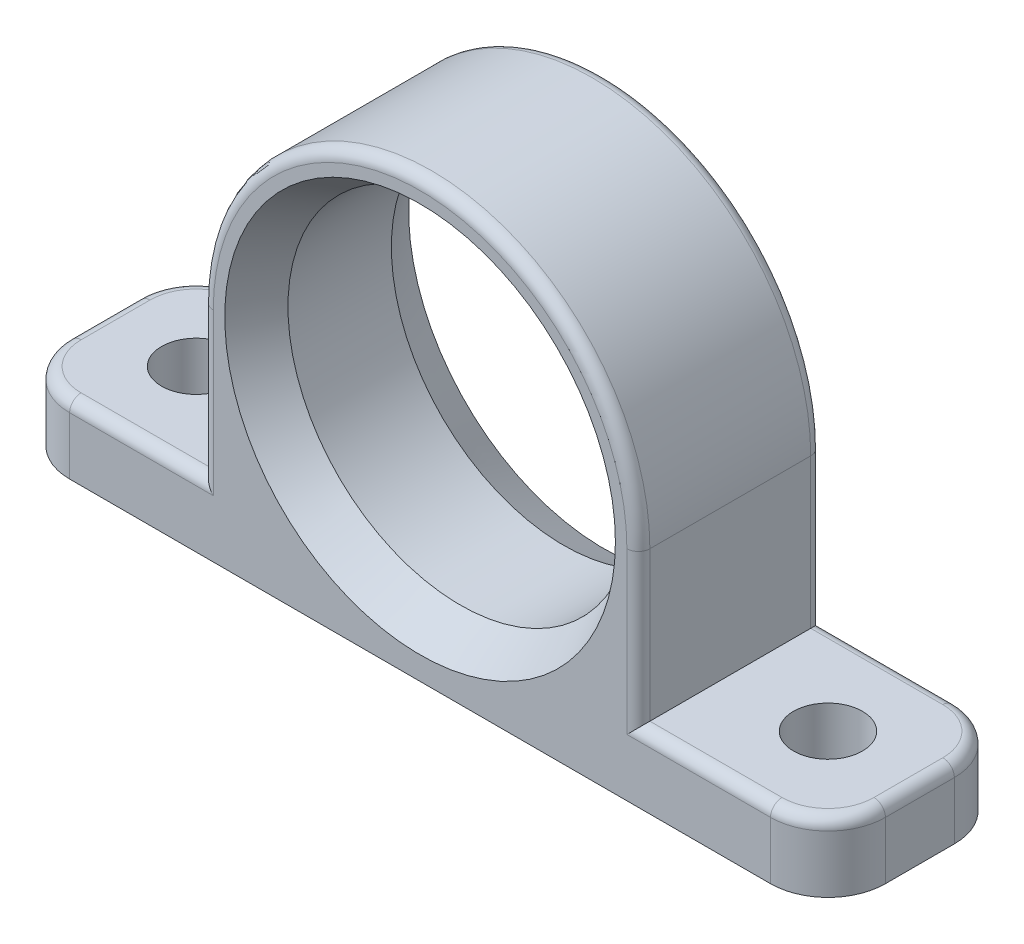
ISO-10303-21;
HEADER;
FILE_DESCRIPTION(('STEP AP214'),'2;1');
FILE_NAME('part.step','',(''),(''),'','','');
FILE_SCHEMA(('AUTOMOTIVE_DESIGN { 1 0 10303 214 1 1 1 1 }'));
ENDSEC;
DATA;
#1=APPLICATION_CONTEXT('core data for automotive mechanical design processes');
#2=APPLICATION_PROTOCOL_DEFINITION('international standard','automotive_design',2000,#1);
#3=PRODUCT_CONTEXT('',#1,'mechanical');
#4=PRODUCT('Part','Part','',(#3));
#5=PRODUCT_RELATED_PRODUCT_CATEGORY('part','',(#4));
#6=PRODUCT_DEFINITION_FORMATION('','',#4);
#7=PRODUCT_DEFINITION_CONTEXT('part definition',#1,'design');
#8=PRODUCT_DEFINITION('design','',#6,#7);
#9=PRODUCT_DEFINITION_SHAPE('','',#8);
#10=(LENGTH_UNIT() NAMED_UNIT(*) SI_UNIT(.MILLI.,.METRE.));
#11=(NAMED_UNIT(*) PLANE_ANGLE_UNIT() SI_UNIT($,.RADIAN.));
#12=(NAMED_UNIT(*) SI_UNIT($,.STERADIAN.) SOLID_ANGLE_UNIT());
#13=UNCERTAINTY_MEASURE_WITH_UNIT(LENGTH_MEASURE(1.E-05),#10,'distance_accuracy_value','');
#14=(GEOMETRIC_REPRESENTATION_CONTEXT(3) GLOBAL_UNCERTAINTY_ASSIGNED_CONTEXT((#13)) GLOBAL_UNIT_ASSIGNED_CONTEXT((#10,
#11,#12)) REPRESENTATION_CONTEXT('',''));
#15=CARTESIAN_POINT('',(0.,0.,0.));
#16=DIRECTION('',(0.,0.,1.));
#17=DIRECTION('',(1.,0.,0.));
#18=AXIS2_PLACEMENT_3D('',#15,#16,#17);
#19=CARTESIAN_POINT('',(0.,19.,16.));
#20=DIRECTION('',(0.,0.,1.));
#21=DIRECTION('',(1.,0.,0.));
#22=AXIS2_PLACEMENT_3D('',#19,#20,#21);
#23=PLANE('',#22);
#24=DIRECTION('',(0.,1.,0.));
#25=VECTOR('',#24,1.);
#26=CARTESIAN_POINT('',(30.5,6.,16.));
#27=LINE('',#26,#25);
#28=CARTESIAN_POINT('',(30.5,0.,16.));
#29=VERTEX_POINT('',#28);
#30=CARTESIAN_POINT('',(30.5,5.,16.));
#31=VERTEX_POINT('',#30);
#32=EDGE_CURVE('E220',#29,#31,#27,.T.);
#33=ORIENTED_EDGE('',*,*,#32,.T.);
#34=DIRECTION('',(-1.,0.,0.));
#35=VECTOR('',#34,1.);
#36=CARTESIAN_POINT('',(19.,5.,16.));
#37=LINE('',#36,#35);
#38=CARTESIAN_POINT('',(18.,5.,16.));
#39=VERTEX_POINT('',#38);
#40=EDGE_CURVE('E251',#31,#39,#37,.T.);
#41=ORIENTED_EDGE('',*,*,#40,.T.);
#42=DIRECTION('',(0.,1.,0.));
#43=VECTOR('',#42,1.);
#44=CARTESIAN_POINT('',(18.,19.,16.));
#45=LINE('',#44,#43);
#46=CARTESIAN_POINT('',(18.,19.,16.));
#47=VERTEX_POINT('',#46);
#48=EDGE_CURVE('E248',#39,#47,#45,.T.);
#49=ORIENTED_EDGE('',*,*,#48,.T.);
#50=CARTESIAN_POINT('',(0.,19.,16.));
#51=DIRECTION('',(0.,0.,1.));
#52=DIRECTION('',(1.,0.,0.));
#53=AXIS2_PLACEMENT_3D('',#50,#51,#52);
#54=CIRCLE('',#53,18.);
#55=CARTESIAN_POINT('',(-18.,19.,16.));
#56=VERTEX_POINT('',#55);
#57=EDGE_CURVE('E246',#47,#56,#54,.T.);
#58=ORIENTED_EDGE('',*,*,#57,.T.);
#59=DIRECTION('',(0.,-1.,0.));
#60=VECTOR('',#59,1.);
#61=CARTESIAN_POINT('',(-18.,6.,16.));
#62=LINE('',#61,#60);
#63=CARTESIAN_POINT('',(-18.,5.,16.));
#64=VERTEX_POINT('',#63);
#65=EDGE_CURVE('E242',#56,#64,#62,.T.);
#66=ORIENTED_EDGE('',*,*,#65,.T.);
#67=DIRECTION('',(-1.,0.,0.));
#68=VECTOR('',#67,1.);
#69=CARTESIAN_POINT('',(-30.5,5.,16.));
#70=LINE('',#69,#68);
#71=CARTESIAN_POINT('',(-30.5,5.,16.));
#72=VERTEX_POINT('',#71);
#73=EDGE_CURVE('E244',#64,#72,#70,.T.);
#74=ORIENTED_EDGE('',*,*,#73,.T.);
#75=DIRECTION('',(0.,-1.,0.));
#76=VECTOR('',#75,1.);
#77=CARTESIAN_POINT('',(-30.5,0.,16.));
#78=LINE('',#77,#76);
#79=CARTESIAN_POINT('',(-30.5,0.,16.));
#80=VERTEX_POINT('',#79);
#81=EDGE_CURVE('E223',#72,#80,#78,.T.);
#82=ORIENTED_EDGE('',*,*,#81,.T.);
#83=DIRECTION('',(1.,0.,0.));
#84=VECTOR('',#83,1.);
#85=CARTESIAN_POINT('',(-35.5,0.,16.));
#86=LINE('',#85,#84);
#87=EDGE_CURVE('E183',#80,#29,#86,.T.);
#88=ORIENTED_EDGE('',*,*,#87,.T.);
#89=EDGE_LOOP('',(#33,#41,#49,#58,#66,#74,#82,#88));
#90=FACE_BOUND('',#89,.T.);
#91=CARTESIAN_POINT('',(0.,19.,16.));
#92=DIRECTION('',(0.,0.,1.));
#93=DIRECTION('',(1.,0.,0.));
#94=AXIS2_PLACEMENT_3D('',#91,#92,#93);
#95=CIRCLE('',#94,17.);
#96=CARTESIAN_POINT('',(17.,19.,16.));
#97=VERTEX_POINT('',#96);
#98=EDGE_CURVE('E233',#97,#97,#95,.F.);
#99=ORIENTED_EDGE('',*,*,#98,.T.);
#100=EDGE_LOOP('',(#99));
#101=FACE_BOUND('',#100,.T.);
#102=ADVANCED_FACE('F39',(#90,#101),#23,.T.);
#103=CARTESIAN_POINT('',(0.,19.,0.));
#104=DIRECTION('',(0.,0.,1.));
#105=DIRECTION('',(1.,0.,0.));
#106=AXIS2_PLACEMENT_3D('',#103,#104,#105);
#107=PLANE('',#106);
#108=DIRECTION('',(0.,-1.,0.));
#109=VECTOR('',#108,1.);
#110=CARTESIAN_POINT('',(-30.5,19.,0.));
#111=LINE('',#110,#109);
#112=CARTESIAN_POINT('',(-30.5,0.,0.));
#113=VERTEX_POINT('',#112);
#114=CARTESIAN_POINT('',(-30.5,5.,0.));
#115=VERTEX_POINT('',#114);
#116=EDGE_CURVE('E218',#113,#115,#111,.F.);
#117=ORIENTED_EDGE('',*,*,#116,.T.);
#118=DIRECTION('',(-1.,0.,0.));
#119=VECTOR('',#118,1.);
#120=CARTESIAN_POINT('',(0.,5.,0.));
#121=LINE('',#120,#119);
#122=CARTESIAN_POINT('',(-18.,5.,0.));
#123=VERTEX_POINT('',#122);
#124=EDGE_CURVE('E63',#115,#123,#121,.F.);
#125=ORIENTED_EDGE('',*,*,#124,.T.);
#126=DIRECTION('',(0.,-1.,0.));
#127=VECTOR('',#126,1.);
#128=CARTESIAN_POINT('',(-18.,19.,0.));
#129=LINE('',#128,#127);
#130=CARTESIAN_POINT('',(-18.,19.,0.));
#131=VERTEX_POINT('',#130);
#132=EDGE_CURVE('E295',#123,#131,#129,.F.);
#133=ORIENTED_EDGE('',*,*,#132,.T.);
#134=CARTESIAN_POINT('',(0.,19.,0.));
#135=DIRECTION('',(0.,0.,1.));
#136=DIRECTION('',(1.,0.,0.));
#137=AXIS2_PLACEMENT_3D('',#134,#135,#136);
#138=CIRCLE('',#137,18.);
#139=CARTESIAN_POINT('',(18.,19.,0.));
#140=VERTEX_POINT('',#139);
#141=EDGE_CURVE('E293',#131,#140,#138,.F.);
#142=ORIENTED_EDGE('',*,*,#141,.T.);
#143=DIRECTION('',(0.,1.,0.));
#144=VECTOR('',#143,1.);
#145=CARTESIAN_POINT('',(18.,19.,0.));
#146=LINE('',#145,#144);
#147=CARTESIAN_POINT('',(18.,5.,0.));
#148=VERTEX_POINT('',#147);
#149=EDGE_CURVE('E56',#140,#148,#146,.F.);
#150=ORIENTED_EDGE('',*,*,#149,.T.);
#151=DIRECTION('',(-1.,0.,0.));
#152=VECTOR('',#151,1.);
#153=CARTESIAN_POINT('',(0.,5.,0.));
#154=LINE('',#153,#152);
#155=CARTESIAN_POINT('',(30.5,5.,0.));
#156=VERTEX_POINT('',#155);
#157=EDGE_CURVE('E298',#148,#156,#154,.F.);
#158=ORIENTED_EDGE('',*,*,#157,.T.);
#159=DIRECTION('',(0.,1.,0.));
#160=VECTOR('',#159,1.);
#161=CARTESIAN_POINT('',(30.5,19.,0.));
#162=LINE('',#161,#160);
#163=CARTESIAN_POINT('',(30.5,0.,0.));
#164=VERTEX_POINT('',#163);
#165=EDGE_CURVE('E216',#156,#164,#162,.F.);
#166=ORIENTED_EDGE('',*,*,#165,.T.);
#167=DIRECTION('',(1.,0.,0.));
#168=VECTOR('',#167,1.);
#169=CARTESIAN_POINT('',(-35.5,0.,0.));
#170=LINE('',#169,#168);
#171=EDGE_CURVE('E363',#113,#164,#170,.T.);
#172=ORIENTED_EDGE('',*,*,#171,.F.);
#173=EDGE_LOOP('',(#117,#125,#133,#142,#150,#158,#166,#172));
#174=FACE_BOUND('',#173,.T.);
#175=CARTESIAN_POINT('',(0.,19.,0.));
#176=DIRECTION('',(0.,0.,1.));
#177=DIRECTION('',(1.,0.,0.));
#178=AXIS2_PLACEMENT_3D('',#175,#176,#177);
#179=CIRCLE('',#178,17.);
#180=CARTESIAN_POINT('',(17.,19.,0.));
#181=VERTEX_POINT('',#180);
#182=EDGE_CURVE('E236',#181,#181,#179,.T.);
#183=ORIENTED_EDGE('',*,*,#182,.T.);
#184=EDGE_LOOP('',(#183));
#185=FACE_BOUND('',#184,.T.);
#186=ADVANCED_FACE('F393',(#174,#185),#107,.F.);
#187=CARTESIAN_POINT('',(35.5,0.,16.));
#188=DIRECTION('',(-1.,0.,0.));
#189=DIRECTION('',(0.,0.,1.));
#190=AXIS2_PLACEMENT_3D('',#187,#188,#189);
#191=PLANE('',#190);
#192=DIRECTION('',(0.,1.,0.));
#193=VECTOR('',#192,1.);
#194=CARTESIAN_POINT('',(35.5,0.,5.));
#195=LINE('',#194,#193);
#196=CARTESIAN_POINT('',(35.5,0.,5.));
#197=VERTEX_POINT('',#196);
#198=CARTESIAN_POINT('',(35.5,5.,5.));
#199=VERTEX_POINT('',#198);
#200=EDGE_CURVE('E227',#197,#199,#195,.T.);
#201=ORIENTED_EDGE('',*,*,#200,.T.);
#202=DIRECTION('',(0.,0.,-1.));
#203=VECTOR('',#202,1.);
#204=CARTESIAN_POINT('',(35.5,5.,16.));
#205=LINE('',#204,#203);
#206=CARTESIAN_POINT('',(35.5,5.,11.));
#207=VERTEX_POINT('',#206);
#208=EDGE_CURVE('E289',#199,#207,#205,.F.);
#209=ORIENTED_EDGE('',*,*,#208,.T.);
#210=DIRECTION('',(0.,1.,0.));
#211=VECTOR('',#210,1.);
#212=CARTESIAN_POINT('',(35.5,0.,11.));
#213=LINE('',#212,#211);
#214=CARTESIAN_POINT('',(35.5,0.,11.));
#215=VERTEX_POINT('',#214);
#216=EDGE_CURVE('E225',#207,#215,#213,.F.);
#217=ORIENTED_EDGE('',*,*,#216,.T.);
#218=DIRECTION('',(0.,0.,-1.));
#219=VECTOR('',#218,1.);
#220=CARTESIAN_POINT('',(35.5,0.,16.));
#221=LINE('',#220,#219);
#222=EDGE_CURVE('E199',#215,#197,#221,.T.);
#223=ORIENTED_EDGE('',*,*,#222,.T.);
#224=EDGE_LOOP('',(#201,#209,#217,#223));
#225=FACE_BOUND('',#224,.T.);
#226=ADVANCED_FACE('F403',(#225),#191,.F.);
#227=CARTESIAN_POINT('',(35.5,6.,16.));
#228=DIRECTION('',(0.,-1.,0.));
#229=DIRECTION('',(1.,0.,0.));
#230=AXIS2_PLACEMENT_3D('',#227,#228,#229);
#231=PLANE('',#230);
#232=CARTESIAN_POINT('',(27.5,5.99999999999999,8.));
#233=DIRECTION('',(0.,1.,0.));
#234=DIRECTION('',(-1.,0.,0.));
#235=AXIS2_PLACEMENT_3D('',#232,#233,#234);
#236=CIRCLE('',#235,2.99999999999999);
#237=CARTESIAN_POINT('',(24.5,5.99999999999999,8.));
#238=VERTEX_POINT('',#237);
#239=EDGE_CURVE('E347',#238,#238,#236,.T.);
#240=ORIENTED_EDGE('',*,*,#239,.F.);
#241=EDGE_LOOP('',(#240));
#242=FACE_BOUND('',#241,.T.);
#243=DIRECTION('',(0.,0.,-1.));
#244=VECTOR('',#243,1.);
#245=CARTESIAN_POINT('',(19.,6.,16.));
#246=LINE('',#245,#244);
#247=CARTESIAN_POINT('',(19.,6.,15.));
#248=VERTEX_POINT('',#247);
#249=CARTESIAN_POINT('',(19.,6.,1.));
#250=VERTEX_POINT('',#249);
#251=EDGE_CURVE('E204',#248,#250,#246,.T.);
#252=ORIENTED_EDGE('',*,*,#251,.F.);
#253=DIRECTION('',(-1.,0.,0.));
#254=VECTOR('',#253,1.);
#255=CARTESIAN_POINT('',(30.5,6.,15.));
#256=LINE('',#255,#254);
#257=CARTESIAN_POINT('',(30.5,6.,15.));
#258=VERTEX_POINT('',#257);
#259=EDGE_CURVE('E285',#248,#258,#256,.F.);
#260=ORIENTED_EDGE('',*,*,#259,.T.);
#261=CARTESIAN_POINT('',(30.5,6.,11.));
#262=DIRECTION('',(0.,-1.,0.));
#263=DIRECTION('',(1.,0.,0.));
#264=AXIS2_PLACEMENT_3D('',#261,#262,#263);
#265=CIRCLE('',#264,4.);
#266=CARTESIAN_POINT('',(34.5,6.,11.));
#267=VERTEX_POINT('',#266);
#268=EDGE_CURVE('E283',#258,#267,#265,.F.);
#269=ORIENTED_EDGE('',*,*,#268,.T.);
#270=DIRECTION('',(0.,0.,-1.));
#271=VECTOR('',#270,1.);
#272=CARTESIAN_POINT('',(34.5,6.,16.));
#273=LINE('',#272,#271);
#274=CARTESIAN_POINT('',(34.5,6.,5.));
#275=VERTEX_POINT('',#274);
#276=EDGE_CURVE('E281',#267,#275,#273,.T.);
#277=ORIENTED_EDGE('',*,*,#276,.T.);
#278=CARTESIAN_POINT('',(30.5,6.,5.));
#279=DIRECTION('',(0.,-1.,0.));
#280=DIRECTION('',(1.,0.,0.));
#281=AXIS2_PLACEMENT_3D('',#278,#279,#280);
#282=CIRCLE('',#281,4.);
#283=CARTESIAN_POINT('',(30.5,6.,1.));
#284=VERTEX_POINT('',#283);
#285=EDGE_CURVE('E279',#275,#284,#282,.F.);
#286=ORIENTED_EDGE('',*,*,#285,.T.);
#287=DIRECTION('',(-1.,0.,0.));
#288=VECTOR('',#287,1.);
#289=CARTESIAN_POINT('',(35.5,6.,1.));
#290=LINE('',#289,#288);
#291=EDGE_CURVE('E277',#284,#250,#290,.T.);
#292=ORIENTED_EDGE('',*,*,#291,.T.);
#293=EDGE_LOOP('',(#252,#260,#269,#277,#286,#292));
#294=FACE_BOUND('',#293,.T.);
#295=ADVANCED_FACE('F492',(#242,#294),#231,.F.);
#296=CARTESIAN_POINT('',(19.,19.,16.));
#297=DIRECTION('',(-1.,0.,0.));
#298=DIRECTION('',(0.,0.,1.));
#299=AXIS2_PLACEMENT_3D('',#296,#297,#298);
#300=PLANE('',#299);
#301=DIRECTION('',(0.,0.,-1.));
#302=VECTOR('',#301,1.);
#303=CARTESIAN_POINT('',(19.,19.,16.));
#304=LINE('',#303,#302);
#305=CARTESIAN_POINT('',(19.,19.,15.));
#306=VERTEX_POINT('',#305);
#307=CARTESIAN_POINT('',(19.,19.,1.));
#308=VERTEX_POINT('',#307);
#309=EDGE_CURVE('E209',#306,#308,#304,.T.);
#310=ORIENTED_EDGE('',*,*,#309,.F.);
#311=DIRECTION('',(0.,1.,0.));
#312=VECTOR('',#311,1.);
#313=CARTESIAN_POINT('',(19.,6.,15.));
#314=LINE('',#313,#312);
#315=EDGE_CURVE('E255',#306,#248,#314,.F.);
#316=ORIENTED_EDGE('',*,*,#315,.T.);
#317=ORIENTED_EDGE('',*,*,#251,.T.);
#318=DIRECTION('',(0.,1.,0.));
#319=VECTOR('',#318,1.);
#320=CARTESIAN_POINT('',(19.,19.,1.));
#321=LINE('',#320,#319);
#322=EDGE_CURVE('E253',#250,#308,#321,.T.);
#323=ORIENTED_EDGE('',*,*,#322,.T.);
#324=EDGE_LOOP('',(#310,#316,#317,#323));
#325=FACE_BOUND('',#324,.T.);
#326=ADVANCED_FACE('F489',(#325),#300,.F.);
#327=CARTESIAN_POINT('',(0.,19.,16.));
#328=DIRECTION('',(0.,0.,-1.));
#329=DIRECTION('',(-1.,0.,0.));
#330=AXIS2_PLACEMENT_3D('',#327,#328,#329);
#331=CYLINDRICAL_SURFACE('',#330,19.);
#332=DIRECTION('',(0.,0.,-1.));
#333=VECTOR('',#332,1.);
#334=CARTESIAN_POINT('',(-19.,19.,16.));
#335=LINE('',#334,#333);
#336=CARTESIAN_POINT('',(-19.,19.,15.));
#337=VERTEX_POINT('',#336);
#338=CARTESIAN_POINT('',(-19.,19.,1.));
#339=VERTEX_POINT('',#338);
#340=EDGE_CURVE('E371',#337,#339,#335,.T.);
#341=ORIENTED_EDGE('',*,*,#340,.F.);
#342=CARTESIAN_POINT('',(0.,19.,15.));
#343=DIRECTION('',(0.,0.,1.));
#344=DIRECTION('',(1.,0.,0.));
#345=AXIS2_PLACEMENT_3D('',#342,#343,#344);
#346=CIRCLE('',#345,19.);
#347=EDGE_CURVE('E260',#337,#306,#346,.F.);
#348=ORIENTED_EDGE('',*,*,#347,.T.);
#349=ORIENTED_EDGE('',*,*,#309,.T.);
#350=CARTESIAN_POINT('',(0.,19.,1.));
#351=DIRECTION('',(0.,0.,1.));
#352=DIRECTION('',(1.,0.,0.));
#353=AXIS2_PLACEMENT_3D('',#350,#351,#352);
#354=CIRCLE('',#353,19.);
#355=EDGE_CURVE('E258',#308,#339,#354,.T.);
#356=ORIENTED_EDGE('',*,*,#355,.T.);
#357=EDGE_LOOP('',(#341,#348,#349,#356));
#358=FACE_BOUND('',#357,.T.);
#359=ADVANCED_FACE('F377',(#358),#331,.T.);
#360=CARTESIAN_POINT('',(-19.,19.,16.));
#361=DIRECTION('',(1.,0.,0.));
#362=DIRECTION('',(0.,0.,-1.));
#363=AXIS2_PLACEMENT_3D('',#360,#361,#362);
#364=PLANE('',#363);
#365=ORIENTED_EDGE('',*,*,#340,.T.);
#366=DIRECTION('',(0.,-1.,0.));
#367=VECTOR('',#366,1.);
#368=CARTESIAN_POINT('',(-19.,19.,1.));
#369=LINE('',#368,#367);
#370=CARTESIAN_POINT('',(-19.,6.,1.));
#371=VERTEX_POINT('',#370);
#372=EDGE_CURVE('E11',#339,#371,#369,.T.);
#373=ORIENTED_EDGE('',*,*,#372,.T.);
#374=DIRECTION('',(0.,0.,-1.));
#375=VECTOR('',#374,1.);
#376=CARTESIAN_POINT('',(-19.,6.,16.));
#377=LINE('',#376,#375);
#378=CARTESIAN_POINT('',(-19.,6.,15.));
#379=VERTEX_POINT('',#378);
#380=EDGE_CURVE('E198',#379,#371,#377,.T.);
#381=ORIENTED_EDGE('',*,*,#380,.F.);
#382=DIRECTION('',(0.,-1.,0.));
#383=VECTOR('',#382,1.);
#384=CARTESIAN_POINT('',(-19.,19.,15.));
#385=LINE('',#384,#383);
#386=EDGE_CURVE('E48',#379,#337,#385,.F.);
#387=ORIENTED_EDGE('',*,*,#386,.T.);
#388=EDGE_LOOP('',(#365,#373,#381,#387));
#389=FACE_BOUND('',#388,.T.);
#390=ADVANCED_FACE('F442',(#389),#364,.F.);
#391=CARTESIAN_POINT('',(-35.5,6.,16.));
#392=DIRECTION('',(0.,-1.,0.));
#393=DIRECTION('',(1.,0.,0.));
#394=AXIS2_PLACEMENT_3D('',#391,#392,#393);
#395=PLANE('',#394);
#396=CARTESIAN_POINT('',(-27.5,6.,8.));
#397=DIRECTION('',(0.,1.,0.));
#398=DIRECTION('',(-1.,0.,0.));
#399=AXIS2_PLACEMENT_3D('',#396,#397,#398);
#400=CIRCLE('',#399,2.99999999999999);
#401=CARTESIAN_POINT('',(-30.5,6.,8.));
#402=VERTEX_POINT('',#401);
#403=EDGE_CURVE('E358',#402,#402,#400,.T.);
#404=ORIENTED_EDGE('',*,*,#403,.F.);
#405=EDGE_LOOP('',(#404));
#406=FACE_BOUND('',#405,.T.);
#407=CARTESIAN_POINT('',(-30.5,6.,11.));
#408=DIRECTION('',(0.,-1.,0.));
#409=DIRECTION('',(1.,0.,0.));
#410=AXIS2_PLACEMENT_3D('',#407,#408,#409);
#411=CIRCLE('',#410,4.);
#412=CARTESIAN_POINT('',(-34.5,6.,11.));
#413=VERTEX_POINT('',#412);
#414=CARTESIAN_POINT('',(-30.5,6.,15.));
#415=VERTEX_POINT('',#414);
#416=EDGE_CURVE('E268',#413,#415,#411,.F.);
#417=ORIENTED_EDGE('',*,*,#416,.T.);
#418=DIRECTION('',(-1.,0.,0.));
#419=VECTOR('',#418,1.);
#420=CARTESIAN_POINT('',(-19.,6.,15.));
#421=LINE('',#420,#419);
#422=EDGE_CURVE('E270',#415,#379,#421,.F.);
#423=ORIENTED_EDGE('',*,*,#422,.T.);
#424=ORIENTED_EDGE('',*,*,#380,.T.);
#425=DIRECTION('',(-1.,0.,0.));
#426=VECTOR('',#425,1.);
#427=CARTESIAN_POINT('',(-35.5,6.,1.));
#428=LINE('',#427,#426);
#429=CARTESIAN_POINT('',(-30.5,6.,1.));
#430=VERTEX_POINT('',#429);
#431=EDGE_CURVE('E262',#371,#430,#428,.T.);
#432=ORIENTED_EDGE('',*,*,#431,.T.);
#433=CARTESIAN_POINT('',(-30.5,6.,5.));
#434=DIRECTION('',(0.,-1.,0.));
#435=DIRECTION('',(1.,0.,0.));
#436=AXIS2_PLACEMENT_3D('',#433,#434,#435);
#437=CIRCLE('',#436,4.);
#438=CARTESIAN_POINT('',(-34.5,6.,5.));
#439=VERTEX_POINT('',#438);
#440=EDGE_CURVE('E264',#430,#439,#437,.F.);
#441=ORIENTED_EDGE('',*,*,#440,.T.);
#442=DIRECTION('',(0.,0.,-1.));
#443=VECTOR('',#442,1.);
#444=CARTESIAN_POINT('',(-34.5,6.,16.));
#445=LINE('',#444,#443);
#446=EDGE_CURVE('E266',#439,#413,#445,.F.);
#447=ORIENTED_EDGE('',*,*,#446,.T.);
#448=EDGE_LOOP('',(#417,#423,#424,#432,#441,#447));
#449=FACE_BOUND('',#448,.T.);
#450=ADVANCED_FACE('F440',(#406,#449),#395,.F.);
#451=CARTESIAN_POINT('',(-35.5,0.,16.));
#452=DIRECTION('',(1.,0.,0.));
#453=DIRECTION('',(0.,0.,-1.));
#454=AXIS2_PLACEMENT_3D('',#451,#452,#453);
#455=PLANE('',#454);
#456=DIRECTION('',(0.,-1.,0.));
#457=VECTOR('',#456,1.);
#458=CARTESIAN_POINT('',(-35.5,6.,11.));
#459=LINE('',#458,#457);
#460=CARTESIAN_POINT('',(-35.5,0.,11.));
#461=VERTEX_POINT('',#460);
#462=CARTESIAN_POINT('',(-35.5,5.,11.));
#463=VERTEX_POINT('',#462);
#464=EDGE_CURVE('E193',#461,#463,#459,.F.);
#465=ORIENTED_EDGE('',*,*,#464,.T.);
#466=DIRECTION('',(0.,0.,-1.));
#467=VECTOR('',#466,1.);
#468=CARTESIAN_POINT('',(-35.5,5.,16.));
#469=LINE('',#468,#467);
#470=CARTESIAN_POINT('',(-35.5,5.,5.));
#471=VERTEX_POINT('',#470);
#472=EDGE_CURVE('E273',#463,#471,#469,.T.);
#473=ORIENTED_EDGE('',*,*,#472,.T.);
#474=DIRECTION('',(0.,-1.,0.));
#475=VECTOR('',#474,1.);
#476=CARTESIAN_POINT('',(-35.5,0.,5.));
#477=LINE('',#476,#475);
#478=CARTESIAN_POINT('',(-35.5,0.,5.));
#479=VERTEX_POINT('',#478);
#480=EDGE_CURVE('E196',#471,#479,#477,.T.);
#481=ORIENTED_EDGE('',*,*,#480,.T.);
#482=DIRECTION('',(0.,0.,-1.));
#483=VECTOR('',#482,1.);
#484=CARTESIAN_POINT('',(-35.5,0.,16.));
#485=LINE('',#484,#483);
#486=EDGE_CURVE('E181',#461,#479,#485,.T.);
#487=ORIENTED_EDGE('',*,*,#486,.F.);
#488=EDGE_LOOP('',(#465,#473,#481,#487));
#489=FACE_BOUND('',#488,.T.);
#490=ADVANCED_FACE('F192',(#489),#455,.F.);
#491=CARTESIAN_POINT('',(-35.5,0.,16.));
#492=DIRECTION('',(0.,1.,0.));
#493=DIRECTION('',(0.,0.,1.));
#494=AXIS2_PLACEMENT_3D('',#491,#492,#493);
#495=PLANE('',#494);
#496=CARTESIAN_POINT('',(-27.5,0.,8.));
#497=DIRECTION('',(0.,1.,0.));
#498=DIRECTION('',(-1.,0.,0.));
#499=AXIS2_PLACEMENT_3D('',#496,#497,#498);
#500=CIRCLE('',#499,2.99999999999999);
#501=CARTESIAN_POINT('',(-30.5,0.,8.));
#502=VERTEX_POINT('',#501);
#503=EDGE_CURVE('E366',#502,#502,#500,.T.);
#504=ORIENTED_EDGE('',*,*,#503,.T.);
#505=EDGE_LOOP('',(#504));
#506=FACE_BOUND('',#505,.T.);
#507=CARTESIAN_POINT('',(27.5,0.,8.));
#508=DIRECTION('',(0.,1.,0.));
#509=DIRECTION('',(-1.,0.,0.));
#510=AXIS2_PLACEMENT_3D('',#507,#508,#509);
#511=CIRCLE('',#510,2.99999999999999);
#512=CARTESIAN_POINT('',(24.5,0.,8.));
#513=VERTEX_POINT('',#512);
#514=EDGE_CURVE('E353',#513,#513,#511,.T.);
#515=ORIENTED_EDGE('',*,*,#514,.T.);
#516=EDGE_LOOP('',(#515));
#517=FACE_BOUND('',#516,.T.);
#518=ORIENTED_EDGE('',*,*,#486,.T.);
#519=CARTESIAN_POINT('',(-30.5,0.,5.));
#520=DIRECTION('',(0.,1.,0.));
#521=DIRECTION('',(0.,0.,1.));
#522=AXIS2_PLACEMENT_3D('',#519,#520,#521);
#523=CIRCLE('',#522,5.);
#524=EDGE_CURVE('E187',#479,#113,#523,.F.);
#525=ORIENTED_EDGE('',*,*,#524,.T.);
#526=ORIENTED_EDGE('',*,*,#171,.T.);
#527=CARTESIAN_POINT('',(30.5,0.,5.));
#528=DIRECTION('',(0.,1.,0.));
#529=DIRECTION('',(0.,0.,1.));
#530=AXIS2_PLACEMENT_3D('',#527,#528,#529);
#531=CIRCLE('',#530,5.);
#532=EDGE_CURVE('E188',#164,#197,#531,.F.);
#533=ORIENTED_EDGE('',*,*,#532,.T.);
#534=ORIENTED_EDGE('',*,*,#222,.F.);
#535=CARTESIAN_POINT('',(30.5,0.,11.));
#536=DIRECTION('',(0.,1.,0.));
#537=DIRECTION('',(0.,0.,1.));
#538=AXIS2_PLACEMENT_3D('',#535,#536,#537);
#539=CIRCLE('',#538,5.);
#540=EDGE_CURVE('E206',#215,#29,#539,.F.);
#541=ORIENTED_EDGE('',*,*,#540,.T.);
#542=ORIENTED_EDGE('',*,*,#87,.F.);
#543=CARTESIAN_POINT('',(-30.5,0.,11.));
#544=DIRECTION('',(0.,1.,0.));
#545=DIRECTION('',(0.,0.,1.));
#546=AXIS2_PLACEMENT_3D('',#543,#544,#545);
#547=CIRCLE('',#546,5.);
#548=EDGE_CURVE('E178',#80,#461,#547,.F.);
#549=ORIENTED_EDGE('',*,*,#548,.T.);
#550=EDGE_LOOP('',(#518,#525,#526,#533,#534,#541,#542,#549));
#551=FACE_BOUND('',#550,.T.);
#552=ADVANCED_FACE('F180',(#506,#517,#551),#495,.F.);
#553=CARTESIAN_POINT('',(0.,19.,16.));
#554=DIRECTION('',(0.,0.,-1.));
#555=DIRECTION('',(-1.,0.,0.));
#556=AXIS2_PLACEMENT_3D('',#553,#554,#555);
#557=CYLINDRICAL_SURFACE('',#556,15.);
#558=CARTESIAN_POINT('',(0.,19.,3.50000000000001));
#559=DIRECTION('',(0.,0.,1.));
#560=DIRECTION('',(1.,0.,0.));
#561=AXIS2_PLACEMENT_3D('',#558,#559,#560);
#562=CIRCLE('',#561,15.);
#563=CARTESIAN_POINT('',(15.,19.,3.50000000000001));
#564=VERTEX_POINT('',#563);
#565=EDGE_CURVE('E239',#564,#564,#562,.F.);
#566=ORIENTED_EDGE('',*,*,#565,.T.);
#567=EDGE_LOOP('',(#566));
#568=FACE_BOUND('',#567,.T.);
#569=CARTESIAN_POINT('',(0.,19.,12.5));
#570=DIRECTION('',(0.,0.,1.));
#571=DIRECTION('',(1.,0.,0.));
#572=AXIS2_PLACEMENT_3D('',#569,#570,#571);
#573=CIRCLE('',#572,15.);
#574=CARTESIAN_POINT('',(15.,19.,12.5));
#575=VERTEX_POINT('',#574);
#576=EDGE_CURVE('E230',#575,#575,#573,.T.);
#577=ORIENTED_EDGE('',*,*,#576,.T.);
#578=EDGE_LOOP('',(#577));
#579=FACE_BOUND('',#578,.T.);
#580=ADVANCED_FACE('F459',(#568,#579),#557,.F.);
#581=CARTESIAN_POINT('',(-30.5,0.,5.));
#582=DIRECTION('',(0.,-1.,0.));
#583=DIRECTION('',(0.,0.,-1.));
#584=AXIS2_PLACEMENT_3D('',#581,#582,#583);
#585=CYLINDRICAL_SURFACE('',#584,5.);
#586=ORIENTED_EDGE('',*,*,#480,.F.);
#587=CARTESIAN_POINT('',(-30.5,5.,5.));
#588=DIRECTION('',(0.,-1.,0.));
#589=DIRECTION('',(1.,0.,0.));
#590=AXIS2_PLACEMENT_3D('',#587,#588,#589);
#591=CIRCLE('',#590,5.);
#592=EDGE_CURVE('E275',#471,#115,#591,.T.);
#593=ORIENTED_EDGE('',*,*,#592,.T.);
#594=ORIENTED_EDGE('',*,*,#116,.F.);
#595=ORIENTED_EDGE('',*,*,#524,.F.);
#596=EDGE_LOOP('',(#586,#593,#594,#595));
#597=FACE_BOUND('',#596,.T.);
#598=ADVANCED_FACE('F456',(#597),#585,.T.);
#599=CARTESIAN_POINT('',(-30.5,19.,11.));
#600=DIRECTION('',(0.,1.,0.));
#601=DIRECTION('',(0.,0.,1.));
#602=AXIS2_PLACEMENT_3D('',#599,#600,#601);
#603=CYLINDRICAL_SURFACE('',#602,5.);
#604=ORIENTED_EDGE('',*,*,#81,.F.);
#605=CARTESIAN_POINT('',(-30.5,5.,11.));
#606=DIRECTION('',(0.,-1.,0.));
#607=DIRECTION('',(1.,0.,0.));
#608=AXIS2_PLACEMENT_3D('',#605,#606,#607);
#609=CIRCLE('',#608,5.);
#610=EDGE_CURVE('E203',#72,#463,#609,.T.);
#611=ORIENTED_EDGE('',*,*,#610,.T.);
#612=ORIENTED_EDGE('',*,*,#464,.F.);
#613=ORIENTED_EDGE('',*,*,#548,.F.);
#614=EDGE_LOOP('',(#604,#611,#612,#613));
#615=FACE_BOUND('',#614,.T.);
#616=ADVANCED_FACE('F201',(#615),#603,.T.);
#617=CARTESIAN_POINT('',(30.5,0.,5.));
#618=DIRECTION('',(0.,1.,0.));
#619=DIRECTION('',(0.,0.,1.));
#620=AXIS2_PLACEMENT_3D('',#617,#618,#619);
#621=CYLINDRICAL_SURFACE('',#620,5.);
#622=ORIENTED_EDGE('',*,*,#165,.F.);
#623=CARTESIAN_POINT('',(30.5,5.,5.));
#624=DIRECTION('',(0.,-1.,0.));
#625=DIRECTION('',(1.,0.,0.));
#626=AXIS2_PLACEMENT_3D('',#623,#624,#625);
#627=CIRCLE('',#626,5.);
#628=EDGE_CURVE('E291',#156,#199,#627,.T.);
#629=ORIENTED_EDGE('',*,*,#628,.T.);
#630=ORIENTED_EDGE('',*,*,#200,.F.);
#631=ORIENTED_EDGE('',*,*,#532,.F.);
#632=EDGE_LOOP('',(#622,#629,#630,#631));
#633=FACE_BOUND('',#632,.T.);
#634=ADVANCED_FACE('F398',(#633),#621,.T.);
#635=CARTESIAN_POINT('',(30.5,19.,11.));
#636=DIRECTION('',(0.,-1.,0.));
#637=DIRECTION('',(0.,0.,-1.));
#638=AXIS2_PLACEMENT_3D('',#635,#636,#637);
#639=CYLINDRICAL_SURFACE('',#638,5.);
#640=ORIENTED_EDGE('',*,*,#216,.F.);
#641=CARTESIAN_POINT('',(30.5,5.,11.));
#642=DIRECTION('',(0.,-1.,0.));
#643=DIRECTION('',(1.,0.,0.));
#644=AXIS2_PLACEMENT_3D('',#641,#642,#643);
#645=CIRCLE('',#644,5.);
#646=EDGE_CURVE('E287',#207,#31,#645,.T.);
#647=ORIENTED_EDGE('',*,*,#646,.T.);
#648=ORIENTED_EDGE('',*,*,#32,.F.);
#649=ORIENTED_EDGE('',*,*,#540,.F.);
#650=EDGE_LOOP('',(#640,#647,#648,#649));
#651=FACE_BOUND('',#650,.T.);
#652=ADVANCED_FACE('F409',(#651),#639,.T.);
#653=CARTESIAN_POINT('',(27.5,0.,8.));
#654=DIRECTION('',(0.,1.,0.));
#655=DIRECTION('',(-1.,0.,0.));
#656=AXIS2_PLACEMENT_3D('',#653,#654,#655);
#657=CYLINDRICAL_SURFACE('',#656,2.99999999999999);
#658=ORIENTED_EDGE('',*,*,#514,.F.);
#659=EDGE_LOOP('',(#658));
#660=FACE_BOUND('',#659,.T.);
#661=ORIENTED_EDGE('',*,*,#239,.T.);
#662=EDGE_LOOP('',(#661));
#663=FACE_BOUND('',#662,.T.);
#664=ADVANCED_FACE('F727',(#660,#663),#657,.F.);
#665=CARTESIAN_POINT('',(-27.5,0.,8.));
#666=DIRECTION('',(0.,1.,0.));
#667=DIRECTION('',(-1.,0.,0.));
#668=AXIS2_PLACEMENT_3D('',#665,#666,#667);
#669=CYLINDRICAL_SURFACE('',#668,2.99999999999999);
#670=ORIENTED_EDGE('',*,*,#503,.F.);
#671=EDGE_LOOP('',(#670));
#672=FACE_BOUND('',#671,.T.);
#673=ORIENTED_EDGE('',*,*,#403,.T.);
#674=EDGE_LOOP('',(#673));
#675=FACE_BOUND('',#674,.T.);
#676=ADVANCED_FACE('F723',(#672,#675),#669,.F.);
#677=CARTESIAN_POINT('',(0.,19.,12.5));
#678=DIRECTION('',(0.,0.,1.));
#679=DIRECTION('',(1.,0.,0.));
#680=AXIS2_PLACEMENT_3D('',#677,#678,#679);
#681=CONICAL_SURFACE('',#680,15.,0.519146114246521);
#682=ORIENTED_EDGE('',*,*,#98,.F.);
#683=EDGE_LOOP('',(#682));
#684=FACE_BOUND('',#683,.T.);
#685=ORIENTED_EDGE('',*,*,#576,.F.);
#686=EDGE_LOOP('',(#685));
#687=FACE_BOUND('',#686,.T.);
#688=ADVANCED_FACE('F540',(#684,#687),#681,.F.);
#689=CARTESIAN_POINT('',(0.,19.,0.));
#690=DIRECTION('',(0.,0.,-1.));
#691=DIRECTION('',(-1.,0.,0.));
#692=AXIS2_PLACEMENT_3D('',#689,#690,#691);
#693=CONICAL_SURFACE('',#692,17.,0.519146114246522);
#694=ORIENTED_EDGE('',*,*,#565,.F.);
#695=EDGE_LOOP('',(#694));
#696=FACE_BOUND('',#695,.T.);
#697=ORIENTED_EDGE('',*,*,#182,.F.);
#698=EDGE_LOOP('',(#697));
#699=FACE_BOUND('',#698,.T.);
#700=ADVANCED_FACE('F545',(#696,#699),#693,.F.);
#701=CARTESIAN_POINT('',(-18.,19.,1.));
#702=DIRECTION('',(0.,-1.,0.));
#703=DIRECTION('',(0.,0.,-1.));
#704=AXIS2_PLACEMENT_3D('',#701,#702,#703);
#705=CYLINDRICAL_SURFACE('',#704,1.);
#706=CARTESIAN_POINT('',(-18.,5.,1.));
#707=DIRECTION('',(-0.707106781186548,-0.707106781186547,0.));
#708=DIRECTION('',(0.707106781186547,-0.707106781186547,0.));
#709=AXIS2_PLACEMENT_3D('',#706,#707,#708);
#710=ELLIPSE('',#709,1.4142135623731,1.);
#711=EDGE_CURVE('E341',#371,#123,#710,.T.);
#712=ORIENTED_EDGE('',*,*,#711,.F.);
#713=ORIENTED_EDGE('',*,*,#372,.F.);
#714=CARTESIAN_POINT('',(-18.,19.,1.));
#715=DIRECTION('',(0.,1.,0.));
#716=DIRECTION('',(0.,0.,1.));
#717=AXIS2_PLACEMENT_3D('',#714,#715,#716);
#718=CIRCLE('',#717,1.);
#719=EDGE_CURVE('E43',#131,#339,#718,.T.);
#720=ORIENTED_EDGE('',*,*,#719,.F.);
#721=ORIENTED_EDGE('',*,*,#132,.F.);
#722=EDGE_LOOP('',(#712,#713,#720,#721));
#723=FACE_BOUND('',#722,.T.);
#724=ADVANCED_FACE('F41',(#723),#705,.T.);
#725=CARTESIAN_POINT('',(0.,19.,1.));
#726=DIRECTION('',(0.,0.,1.));
#727=DIRECTION('',(1.,0.,0.));
#728=AXIS2_PLACEMENT_3D('',#725,#726,#727);
#729=TOROIDAL_SURFACE('',#728,18.,1.);
#730=ORIENTED_EDGE('',*,*,#719,.T.);
#731=ORIENTED_EDGE('',*,*,#355,.F.);
#732=CARTESIAN_POINT('',(18.,19.,1.));
#733=DIRECTION('',(0.,-1.,0.));
#734=DIRECTION('',(0.,0.,-1.));
#735=AXIS2_PLACEMENT_3D('',#732,#733,#734);
#736=CIRCLE('',#735,1.);
#737=EDGE_CURVE('E339',#140,#308,#736,.T.);
#738=ORIENTED_EDGE('',*,*,#737,.F.);
#739=ORIENTED_EDGE('',*,*,#141,.F.);
#740=EDGE_LOOP('',(#730,#731,#738,#739));
#741=FACE_BOUND('',#740,.T.);
#742=ADVANCED_FACE('F382',(#741),#729,.T.);
#743=CARTESIAN_POINT('',(-35.5,5.,1.));
#744=DIRECTION('',(-1.,0.,0.));
#745=DIRECTION('',(0.,-1.,0.));
#746=AXIS2_PLACEMENT_3D('',#743,#744,#745);
#747=CYLINDRICAL_SURFACE('',#746,1.);
#748=ORIENTED_EDGE('',*,*,#711,.T.);
#749=ORIENTED_EDGE('',*,*,#124,.F.);
#750=CARTESIAN_POINT('',(-30.5,5.,1.));
#751=DIRECTION('',(-1.,0.,0.));
#752=DIRECTION('',(0.,0.,1.));
#753=AXIS2_PLACEMENT_3D('',#750,#751,#752);
#754=CIRCLE('',#753,1.);
#755=EDGE_CURVE('E336',#430,#115,#754,.T.);
#756=ORIENTED_EDGE('',*,*,#755,.F.);
#757=ORIENTED_EDGE('',*,*,#431,.F.);
#758=EDGE_LOOP('',(#748,#749,#756,#757));
#759=FACE_BOUND('',#758,.T.);
#760=ADVANCED_FACE('F446',(#759),#747,.T.);
#761=CARTESIAN_POINT('',(18.,19.,1.));
#762=DIRECTION('',(0.,1.,0.));
#763=DIRECTION('',(0.,0.,1.));
#764=AXIS2_PLACEMENT_3D('',#761,#762,#763);
#765=CYLINDRICAL_SURFACE('',#764,1.);
#766=ORIENTED_EDGE('',*,*,#737,.T.);
#767=ORIENTED_EDGE('',*,*,#322,.F.);
#768=CARTESIAN_POINT('',(18.,5.,1.));
#769=DIRECTION('',(-0.707106781186548,0.707106781186547,0.));
#770=DIRECTION('',(0.707106781186547,0.707106781186547,0.));
#771=AXIS2_PLACEMENT_3D('',#768,#769,#770);
#772=ELLIPSE('',#771,1.4142135623731,1.);
#773=EDGE_CURVE('E333',#148,#250,#772,.F.);
#774=ORIENTED_EDGE('',*,*,#773,.F.);
#775=ORIENTED_EDGE('',*,*,#149,.F.);
#776=EDGE_LOOP('',(#766,#767,#774,#775));
#777=FACE_BOUND('',#776,.T.);
#778=ADVANCED_FACE('F385',(#777),#765,.T.);
#779=CARTESIAN_POINT('',(-30.5,5.,5.));
#780=DIRECTION('',(0.,-1.,0.));
#781=DIRECTION('',(1.,0.,0.));
#782=AXIS2_PLACEMENT_3D('',#779,#780,#781);
#783=TOROIDAL_SURFACE('',#782,4.,1.);
#784=ORIENTED_EDGE('',*,*,#755,.T.);
#785=ORIENTED_EDGE('',*,*,#592,.F.);
#786=CARTESIAN_POINT('',(-34.5,5.,5.));
#787=DIRECTION('',(0.,0.,1.));
#788=DIRECTION('',(1.,0.,0.));
#789=AXIS2_PLACEMENT_3D('',#786,#787,#788);
#790=CIRCLE('',#789,1.);
#791=EDGE_CURVE('E330',#439,#471,#790,.T.);
#792=ORIENTED_EDGE('',*,*,#791,.F.);
#793=ORIENTED_EDGE('',*,*,#440,.F.);
#794=EDGE_LOOP('',(#784,#785,#792,#793));
#795=FACE_BOUND('',#794,.T.);
#796=ADVANCED_FACE('F452',(#795),#783,.T.);
#797=CARTESIAN_POINT('',(35.5,5.,1.));
#798=DIRECTION('',(-1.,0.,0.));
#799=DIRECTION('',(0.,-1.,0.));
#800=AXIS2_PLACEMENT_3D('',#797,#798,#799);
#801=CYLINDRICAL_SURFACE('',#800,1.);
#802=ORIENTED_EDGE('',*,*,#773,.T.);
#803=ORIENTED_EDGE('',*,*,#291,.F.);
#804=CARTESIAN_POINT('',(30.5,5.,1.));
#805=DIRECTION('',(1.,0.,0.));
#806=DIRECTION('',(0.,0.,-1.));
#807=AXIS2_PLACEMENT_3D('',#804,#805,#806);
#808=CIRCLE('',#807,1.);
#809=EDGE_CURVE('E327',#156,#284,#808,.T.);
#810=ORIENTED_EDGE('',*,*,#809,.F.);
#811=ORIENTED_EDGE('',*,*,#157,.F.);
#812=EDGE_LOOP('',(#802,#803,#810,#811));
#813=FACE_BOUND('',#812,.T.);
#814=ADVANCED_FACE('F390',(#813),#801,.T.);
#815=CARTESIAN_POINT('',(-34.5,5.,16.));
#816=DIRECTION('',(0.,0.,-1.));
#817=DIRECTION('',(-1.,0.,0.));
#818=AXIS2_PLACEMENT_3D('',#815,#816,#817);
#819=CYLINDRICAL_SURFACE('',#818,1.);
#820=ORIENTED_EDGE('',*,*,#791,.T.);
#821=ORIENTED_EDGE('',*,*,#472,.F.);
#822=CARTESIAN_POINT('',(-34.5,5.,11.));
#823=DIRECTION('',(0.,0.,1.));
#824=DIRECTION('',(1.,0.,0.));
#825=AXIS2_PLACEMENT_3D('',#822,#823,#824);
#826=CIRCLE('',#825,1.);
#827=EDGE_CURVE('E324',#413,#463,#826,.T.);
#828=ORIENTED_EDGE('',*,*,#827,.F.);
#829=ORIENTED_EDGE('',*,*,#446,.F.);
#830=EDGE_LOOP('',(#820,#821,#828,#829));
#831=FACE_BOUND('',#830,.T.);
#832=ADVANCED_FACE('F454',(#831),#819,.T.);
#833=CARTESIAN_POINT('',(30.5,5.,5.));
#834=DIRECTION('',(0.,-1.,0.));
#835=DIRECTION('',(1.,0.,0.));
#836=AXIS2_PLACEMENT_3D('',#833,#834,#835);
#837=TOROIDAL_SURFACE('',#836,4.,1.);
#838=ORIENTED_EDGE('',*,*,#809,.T.);
#839=ORIENTED_EDGE('',*,*,#285,.F.);
#840=CARTESIAN_POINT('',(34.5,5.,5.));
#841=DIRECTION('',(0.,0.,1.));
#842=DIRECTION('',(1.,0.,0.));
#843=AXIS2_PLACEMENT_3D('',#840,#841,#842);
#844=CIRCLE('',#843,1.);
#845=EDGE_CURVE('E321',#199,#275,#844,.T.);
#846=ORIENTED_EDGE('',*,*,#845,.F.);
#847=ORIENTED_EDGE('',*,*,#628,.F.);
#848=EDGE_LOOP('',(#838,#839,#846,#847));
#849=FACE_BOUND('',#848,.T.);
#850=ADVANCED_FACE('F619',(#849),#837,.T.);
#851=CARTESIAN_POINT('',(-30.5,5.,11.));
#852=DIRECTION('',(0.,-1.,0.));
#853=DIRECTION('',(1.,0.,0.));
#854=AXIS2_PLACEMENT_3D('',#851,#852,#853);
#855=TOROIDAL_SURFACE('',#854,4.,1.);
#856=ORIENTED_EDGE('',*,*,#827,.T.);
#857=ORIENTED_EDGE('',*,*,#610,.F.);
#858=CARTESIAN_POINT('',(-30.5,5.,15.));
#859=DIRECTION('',(1.,0.,0.));
#860=DIRECTION('',(0.,0.,-1.));
#861=AXIS2_PLACEMENT_3D('',#858,#859,#860);
#862=CIRCLE('',#861,1.);
#863=EDGE_CURVE('E318',#415,#72,#862,.T.);
#864=ORIENTED_EDGE('',*,*,#863,.F.);
#865=ORIENTED_EDGE('',*,*,#416,.F.);
#866=EDGE_LOOP('',(#856,#857,#864,#865));
#867=FACE_BOUND('',#866,.T.);
#868=ADVANCED_FACE('F430',(#867),#855,.T.);
#869=CARTESIAN_POINT('',(34.5,5.,16.));
#870=DIRECTION('',(0.,0.,-1.));
#871=DIRECTION('',(-1.,0.,0.));
#872=AXIS2_PLACEMENT_3D('',#869,#870,#871);
#873=CYLINDRICAL_SURFACE('',#872,1.);
#874=ORIENTED_EDGE('',*,*,#845,.T.);
#875=ORIENTED_EDGE('',*,*,#276,.F.);
#876=CARTESIAN_POINT('',(34.5,5.,11.));
#877=DIRECTION('',(0.,0.,1.));
#878=DIRECTION('',(1.,0.,0.));
#879=AXIS2_PLACEMENT_3D('',#876,#877,#878);
#880=CIRCLE('',#879,1.);
#881=EDGE_CURVE('E315',#207,#267,#880,.T.);
#882=ORIENTED_EDGE('',*,*,#881,.F.);
#883=ORIENTED_EDGE('',*,*,#208,.F.);
#884=EDGE_LOOP('',(#874,#875,#882,#883));
#885=FACE_BOUND('',#884,.T.);
#886=ADVANCED_FACE('F414',(#885),#873,.T.);
#887=CARTESIAN_POINT('',(0.,5.,15.));
#888=DIRECTION('',(1.,0.,0.));
#889=DIRECTION('',(0.,1.,0.));
#890=AXIS2_PLACEMENT_3D('',#887,#888,#889);
#891=CYLINDRICAL_SURFACE('',#890,1.);
#892=ORIENTED_EDGE('',*,*,#863,.T.);
#893=ORIENTED_EDGE('',*,*,#73,.F.);
#894=CARTESIAN_POINT('',(-18.,5.,15.));
#895=DIRECTION('',(0.707106781186548,0.707106781186547,0.));
#896=DIRECTION('',(0.707106781186547,-0.707106781186547,0.));
#897=AXIS2_PLACEMENT_3D('',#894,#895,#896);
#898=ELLIPSE('',#897,1.4142135623731,1.);
#899=EDGE_CURVE('E312',#379,#64,#898,.T.);
#900=ORIENTED_EDGE('',*,*,#899,.F.);
#901=ORIENTED_EDGE('',*,*,#422,.F.);
#902=EDGE_LOOP('',(#892,#893,#900,#901));
#903=FACE_BOUND('',#902,.T.);
#904=ADVANCED_FACE('F435',(#903),#891,.T.);
#905=CARTESIAN_POINT('',(30.5,5.,11.));
#906=DIRECTION('',(0.,-1.,0.));
#907=DIRECTION('',(1.,0.,0.));
#908=AXIS2_PLACEMENT_3D('',#905,#906,#907);
#909=TOROIDAL_SURFACE('',#908,4.,1.);
#910=ORIENTED_EDGE('',*,*,#881,.T.);
#911=ORIENTED_EDGE('',*,*,#268,.F.);
#912=CARTESIAN_POINT('',(30.5,5.,15.));
#913=DIRECTION('',(-1.,0.,0.));
#914=DIRECTION('',(0.,0.,1.));
#915=AXIS2_PLACEMENT_3D('',#912,#913,#914);
#916=CIRCLE('',#915,1.);
#917=EDGE_CURVE('E309',#31,#258,#916,.T.);
#918=ORIENTED_EDGE('',*,*,#917,.F.);
#919=ORIENTED_EDGE('',*,*,#646,.F.);
#920=EDGE_LOOP('',(#910,#911,#918,#919));
#921=FACE_BOUND('',#920,.T.);
#922=ADVANCED_FACE('F418',(#921),#909,.T.);
#923=CARTESIAN_POINT('',(-18.,19.,15.));
#924=DIRECTION('',(0.,1.,0.));
#925=DIRECTION('',(0.,0.,1.));
#926=AXIS2_PLACEMENT_3D('',#923,#924,#925);
#927=CYLINDRICAL_SURFACE('',#926,1.);
#928=ORIENTED_EDGE('',*,*,#899,.T.);
#929=ORIENTED_EDGE('',*,*,#65,.F.);
#930=CARTESIAN_POINT('',(-18.,19.,15.));
#931=DIRECTION('',(0.,1.,0.));
#932=DIRECTION('',(0.,0.,1.));
#933=AXIS2_PLACEMENT_3D('',#930,#931,#932);
#934=CIRCLE('',#933,1.);
#935=EDGE_CURVE('E306',#337,#56,#934,.T.);
#936=ORIENTED_EDGE('',*,*,#935,.F.);
#937=ORIENTED_EDGE('',*,*,#386,.F.);
#938=EDGE_LOOP('',(#928,#929,#936,#937));
#939=FACE_BOUND('',#938,.T.);
#940=ADVANCED_FACE('F651',(#939),#927,.T.);
#941=CARTESIAN_POINT('',(0.,5.,15.));
#942=DIRECTION('',(1.,0.,0.));
#943=DIRECTION('',(0.,1.,0.));
#944=AXIS2_PLACEMENT_3D('',#941,#942,#943);
#945=CYLINDRICAL_SURFACE('',#944,1.);
#946=ORIENTED_EDGE('',*,*,#917,.T.);
#947=ORIENTED_EDGE('',*,*,#259,.F.);
#948=CARTESIAN_POINT('',(18.,5.,15.));
#949=DIRECTION('',(0.707106781186548,-0.707106781186547,0.));
#950=DIRECTION('',(-0.707106781186547,-0.707106781186547,0.));
#951=AXIS2_PLACEMENT_3D('',#948,#949,#950);
#952=ELLIPSE('',#951,1.4142135623731,1.);
#953=EDGE_CURVE('E304',#39,#248,#952,.F.);
#954=ORIENTED_EDGE('',*,*,#953,.F.);
#955=ORIENTED_EDGE('',*,*,#40,.F.);
#956=EDGE_LOOP('',(#946,#947,#954,#955));
#957=FACE_BOUND('',#956,.T.);
#958=ADVANCED_FACE('F423',(#957),#945,.T.);
#959=CARTESIAN_POINT('',(0.,19.,15.));
#960=DIRECTION('',(0.,0.,1.));
#961=DIRECTION('',(1.,0.,0.));
#962=AXIS2_PLACEMENT_3D('',#959,#960,#961);
#963=TOROIDAL_SURFACE('',#962,18.,1.);
#964=ORIENTED_EDGE('',*,*,#935,.T.);
#965=ORIENTED_EDGE('',*,*,#57,.F.);
#966=CARTESIAN_POINT('',(18.,19.,15.));
#967=DIRECTION('',(0.,-1.,0.));
#968=DIRECTION('',(0.,0.,-1.));
#969=AXIS2_PLACEMENT_3D('',#966,#967,#968);
#970=CIRCLE('',#969,1.);
#971=EDGE_CURVE('E302',#306,#47,#970,.T.);
#972=ORIENTED_EDGE('',*,*,#971,.F.);
#973=ORIENTED_EDGE('',*,*,#347,.F.);
#974=EDGE_LOOP('',(#964,#965,#972,#973));
#975=FACE_BOUND('',#974,.T.);
#976=ADVANCED_FACE('F665',(#975),#963,.T.);
#977=CARTESIAN_POINT('',(18.,19.,15.));
#978=DIRECTION('',(0.,-1.,0.));
#979=DIRECTION('',(0.,0.,-1.));
#980=AXIS2_PLACEMENT_3D('',#977,#978,#979);
#981=CYLINDRICAL_SURFACE('',#980,1.);
#982=ORIENTED_EDGE('',*,*,#953,.T.);
#983=ORIENTED_EDGE('',*,*,#315,.F.);
#984=ORIENTED_EDGE('',*,*,#971,.T.);
#985=ORIENTED_EDGE('',*,*,#48,.F.);
#986=EDGE_LOOP('',(#982,#983,#984,#985));
#987=FACE_BOUND('',#986,.T.);
#988=ADVANCED_FACE('F672',(#987),#981,.T.);
#989=CLOSED_SHELL('',(#102,#186,#226,#295,#326,#359,#390,#450,#490,#552,#580,#598,#616,#634,
#652,#664,#676,#688,#700,#724,#742,#760,#778,#796,#814,#832,#850,#868,#886,#904,#922,#940,#958,
#976,#988));
#990=MANIFOLD_SOLID_BREP('B2',#989);
#991=ADVANCED_BREP_SHAPE_REPRESENTATION('',(#18,#990),#14);
#992=SHAPE_DEFINITION_REPRESENTATION(#9,#991);
ENDSEC;
END-ISO-10303-21;
